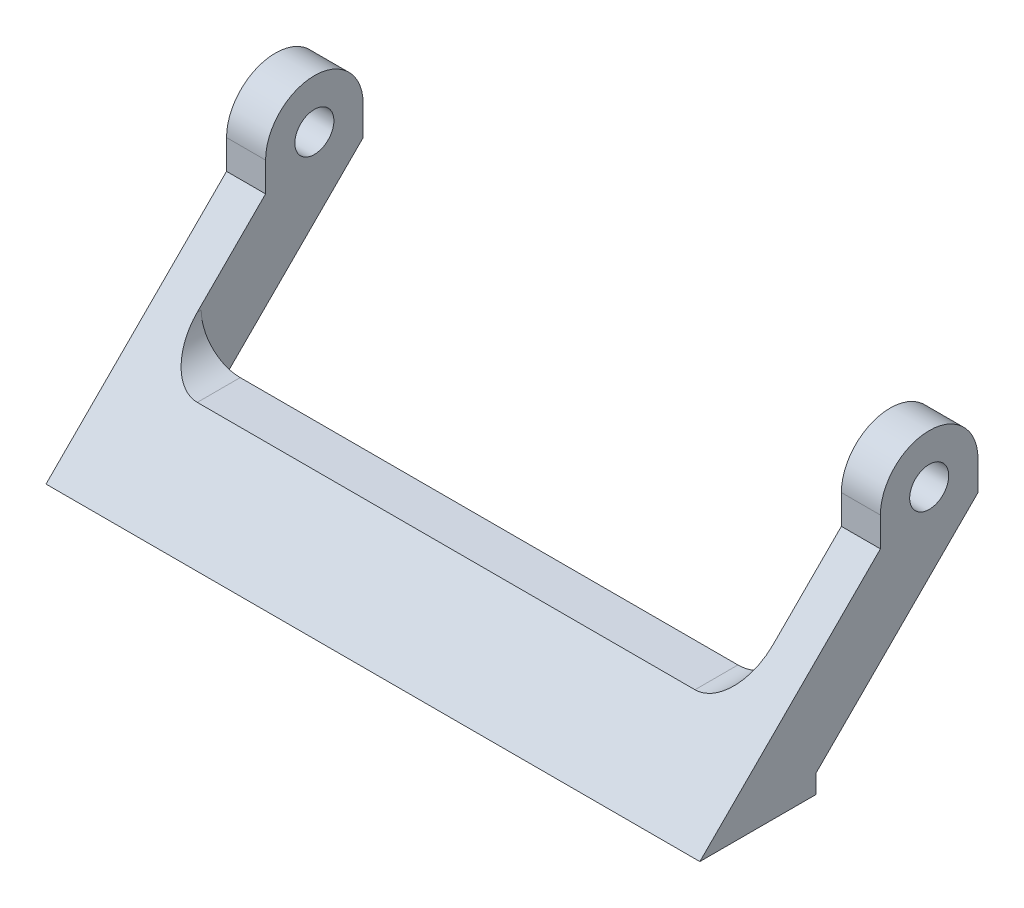
ISO-10303-21;
HEADER;
FILE_DESCRIPTION(('STEP AP214'),'2;1');
FILE_NAME('part.step','',(''),(''),'','','');
FILE_SCHEMA(('AUTOMOTIVE_DESIGN { 1 0 10303 214 1 1 1 1 }'));
ENDSEC;
DATA;
#1=APPLICATION_CONTEXT('core data for automotive mechanical design processes');
#2=APPLICATION_PROTOCOL_DEFINITION('international standard','automotive_design',2000,#1);
#3=PRODUCT_CONTEXT('',#1,'mechanical');
#4=PRODUCT('Part','Part','',(#3));
#5=PRODUCT_RELATED_PRODUCT_CATEGORY('part','',(#4));
#6=PRODUCT_DEFINITION_FORMATION('','',#4);
#7=PRODUCT_DEFINITION_CONTEXT('part definition',#1,'design');
#8=PRODUCT_DEFINITION('design','',#6,#7);
#9=PRODUCT_DEFINITION_SHAPE('','',#8);
#10=(LENGTH_UNIT() NAMED_UNIT(*) SI_UNIT(.MILLI.,.METRE.));
#11=(NAMED_UNIT(*) PLANE_ANGLE_UNIT() SI_UNIT($,.RADIAN.));
#12=(NAMED_UNIT(*) SI_UNIT($,.STERADIAN.) SOLID_ANGLE_UNIT());
#13=UNCERTAINTY_MEASURE_WITH_UNIT(LENGTH_MEASURE(1.E-05),#10,'distance_accuracy_value','');
#14=(GEOMETRIC_REPRESENTATION_CONTEXT(3) GLOBAL_UNCERTAINTY_ASSIGNED_CONTEXT((#13)) GLOBAL_UNIT_ASSIGNED_CONTEXT((#10,
#11,#12)) REPRESENTATION_CONTEXT('',''));
#15=CARTESIAN_POINT('',(0.,0.,0.));
#16=DIRECTION('',(0.,0.,1.));
#17=DIRECTION('',(1.,0.,0.));
#18=AXIS2_PLACEMENT_3D('',#15,#16,#17);
#19=CARTESIAN_POINT('',(67.,18.5,-28.5000000000002));
#20=DIRECTION('',(0.,0.707106781186551,0.707106781186544));
#21=DIRECTION('',(0.,-0.707106781186544,0.707106781186551));
#22=AXIS2_PLACEMENT_3D('',#19,#20,#21);
#23=PLANE('',#22);
#24=DIRECTION('',(0.,0.707106781186544,-0.707106781186551));
#25=VECTOR('',#24,1.);
#26=CARTESIAN_POINT('',(4.,0.749499999999965,-10.7495));
#27=LINE('',#26,#25);
#28=CARTESIAN_POINT('',(3.99999999999998,1.9,-11.9));
#29=VERTEX_POINT('',#28);
#30=CARTESIAN_POINT('',(4.,18.5,-28.5000000000002));
#31=VERTEX_POINT('',#30);
#32=EDGE_CURVE('E153',#29,#31,#27,.T.);
#33=ORIENTED_EDGE('',*,*,#32,.F.);
#34=DIRECTION('',(-1.,0.,0.));
#35=VECTOR('',#34,1.);
#36=CARTESIAN_POINT('',(67.,1.9,-11.9));
#37=LINE('',#36,#35);
#38=CARTESIAN_POINT('',(0.,1.9,-11.9));
#39=VERTEX_POINT('',#38);
#40=EDGE_CURVE('E168',#29,#39,#37,.T.);
#41=ORIENTED_EDGE('',*,*,#40,.T.);
#42=DIRECTION('',(0.,0.707106781186544,-0.707106781186551));
#43=VECTOR('',#42,1.);
#44=CARTESIAN_POINT('',(0.,18.5,-28.5000000000002));
#45=LINE('',#44,#43);
#46=CARTESIAN_POINT('',(0.,18.5,-28.5000000000002));
#47=VERTEX_POINT('',#46);
#48=EDGE_CURVE('E213',#39,#47,#45,.T.);
#49=ORIENTED_EDGE('',*,*,#48,.T.);
#50=DIRECTION('',(-1.,0.,0.));
#51=VECTOR('',#50,1.);
#52=CARTESIAN_POINT('',(67.,18.5,-28.5000000000002));
#53=LINE('',#52,#51);
#54=EDGE_CURVE('E41',#31,#47,#53,.T.);
#55=ORIENTED_EDGE('',*,*,#54,.F.);
#56=EDGE_LOOP('',(#33,#41,#49,#55));
#57=FACE_BOUND('',#56,.T.);
#58=ADVANCED_FACE('F33',(#57),#23,.F.);
#59=CARTESIAN_POINT('',(67.,21.5,-28.5000000000002));
#60=DIRECTION('',(0.,0.,1.));
#61=DIRECTION('',(1.,0.,0.));
#62=AXIS2_PLACEMENT_3D('',#59,#60,#61);
#63=PLANE('',#62);
#64=DIRECTION('',(-1.,0.,0.));
#65=VECTOR('',#64,1.);
#66=CARTESIAN_POINT('',(67.,21.5,-28.5000000000002));
#67=LINE('',#66,#65);
#68=CARTESIAN_POINT('',(4.,21.5,-28.5000000000002));
#69=VERTEX_POINT('',#68);
#70=CARTESIAN_POINT('',(0.,21.5,-28.5000000000002));
#71=VERTEX_POINT('',#70);
#72=EDGE_CURVE('E187',#69,#71,#67,.T.);
#73=ORIENTED_EDGE('',*,*,#72,.F.);
#74=DIRECTION('',(0.,1.,0.));
#75=VECTOR('',#74,1.);
#76=CARTESIAN_POINT('',(4.,11.5,-28.5000000000002));
#77=LINE('',#76,#75);
#78=EDGE_CURVE('E265',#31,#69,#77,.T.);
#79=ORIENTED_EDGE('',*,*,#78,.F.);
#80=ORIENTED_EDGE('',*,*,#54,.T.);
#81=DIRECTION('',(0.,1.,0.));
#82=VECTOR('',#81,1.);
#83=CARTESIAN_POINT('',(0.,21.5,-28.5000000000002));
#84=LINE('',#83,#82);
#85=EDGE_CURVE('E207',#47,#71,#84,.T.);
#86=ORIENTED_EDGE('',*,*,#85,.T.);
#87=EDGE_LOOP('',(#73,#79,#80,#86));
#88=FACE_BOUND('',#87,.T.);
#89=ADVANCED_FACE('F208',(#88),#63,.F.);
#90=CARTESIAN_POINT('',(67.,21.5,-23.5000000000002));
#91=DIRECTION('',(-1.,0.,0.));
#92=DIRECTION('',(0.,0.,1.));
#93=AXIS2_PLACEMENT_3D('',#90,#91,#92);
#94=CYLINDRICAL_SURFACE('',#93,5.);
#95=DIRECTION('',(-1.,0.,0.));
#96=VECTOR('',#95,1.);
#97=CARTESIAN_POINT('',(67.,21.5,-18.5000000000002));
#98=LINE('',#97,#96);
#99=CARTESIAN_POINT('',(4.,21.5,-18.5000000000002));
#100=VERTEX_POINT('',#99);
#101=CARTESIAN_POINT('',(0.,21.5,-18.5000000000002));
#102=VERTEX_POINT('',#101);
#103=EDGE_CURVE('E184',#100,#102,#98,.T.);
#104=ORIENTED_EDGE('',*,*,#103,.F.);
#105=CARTESIAN_POINT('',(4.,21.5,-23.5000000000002));
#106=DIRECTION('',(-1.,0.,0.));
#107=DIRECTION('',(0.,-1.,0.));
#108=AXIS2_PLACEMENT_3D('',#105,#106,#107);
#109=CIRCLE('',#108,5.);
#110=EDGE_CURVE('E154',#69,#100,#109,.F.);
#111=ORIENTED_EDGE('',*,*,#110,.F.);
#112=ORIENTED_EDGE('',*,*,#72,.T.);
#113=CARTESIAN_POINT('',(0.,21.5,-23.5000000000002));
#114=DIRECTION('',(1.,0.,0.));
#115=DIRECTION('',(0.,0.,1.));
#116=AXIS2_PLACEMENT_3D('',#113,#114,#115);
#117=CIRCLE('',#116,5.);
#118=EDGE_CURVE('E202',#71,#102,#117,.T.);
#119=ORIENTED_EDGE('',*,*,#118,.T.);
#120=EDGE_LOOP('',(#104,#111,#112,#119));
#121=FACE_BOUND('',#120,.T.);
#122=ADVANCED_FACE('F200',(#121),#94,.T.);
#123=CARTESIAN_POINT('',(67.,18.5,-18.5000000000002));
#124=DIRECTION('',(0.,0.,-1.));
#125=DIRECTION('',(-1.,0.,0.));
#126=AXIS2_PLACEMENT_3D('',#123,#124,#125);
#127=PLANE('',#126);
#128=DIRECTION('',(-1.,0.,0.));
#129=VECTOR('',#128,1.);
#130=CARTESIAN_POINT('',(67.,18.5,-18.5000000000002));
#131=LINE('',#130,#129);
#132=CARTESIAN_POINT('',(4.,18.5,-18.5000000000002));
#133=VERTEX_POINT('',#132);
#134=CARTESIAN_POINT('',(0.,18.5,-18.5000000000002));
#135=VERTEX_POINT('',#134);
#136=EDGE_CURVE('E180',#133,#135,#131,.T.);
#137=ORIENTED_EDGE('',*,*,#136,.F.);
#138=DIRECTION('',(0.,-1.,0.));
#139=VECTOR('',#138,1.);
#140=CARTESIAN_POINT('',(4.,11.5,-18.5000000000002));
#141=LINE('',#140,#139);
#142=EDGE_CURVE('E275',#100,#133,#141,.T.);
#143=ORIENTED_EDGE('',*,*,#142,.F.);
#144=ORIENTED_EDGE('',*,*,#103,.T.);
#145=DIRECTION('',(0.,-1.,0.));
#146=VECTOR('',#145,1.);
#147=CARTESIAN_POINT('',(0.,18.5,-18.5000000000002));
#148=LINE('',#147,#146);
#149=EDGE_CURVE('E219',#102,#135,#148,.T.);
#150=ORIENTED_EDGE('',*,*,#149,.T.);
#151=EDGE_LOOP('',(#137,#143,#144,#150));
#152=FACE_BOUND('',#151,.T.);
#153=ADVANCED_FACE('F376',(#152),#127,.F.);
#154=CARTESIAN_POINT('',(67.,21.5,-23.5000000000002));
#155=DIRECTION('',(-1.,0.,0.));
#156=DIRECTION('',(0.,0.,1.));
#157=AXIS2_PLACEMENT_3D('',#154,#155,#156);
#158=CYLINDRICAL_SURFACE('',#157,2.00000000000001);
#159=CARTESIAN_POINT('',(4.,21.5,-23.5000000000002));
#160=DIRECTION('',(-1.,0.,0.));
#161=DIRECTION('',(0.,-1.,0.));
#162=AXIS2_PLACEMENT_3D('',#159,#160,#161);
#163=CIRCLE('',#162,2.00000000000001);
#164=CARTESIAN_POINT('',(4.,19.5,-23.5000000000002));
#165=VERTEX_POINT('',#164);
#166=EDGE_CURVE('E262',#165,#165,#163,.F.);
#167=ORIENTED_EDGE('',*,*,#166,.T.);
#168=EDGE_LOOP('',(#167));
#169=FACE_BOUND('',#168,.T.);
#170=CARTESIAN_POINT('',(0.,21.5,-23.5000000000002));
#171=DIRECTION('',(1.,0.,0.));
#172=DIRECTION('',(0.,0.,-1.));
#173=AXIS2_PLACEMENT_3D('',#170,#171,#172);
#174=CIRCLE('',#173,2.00000000000001);
#175=CARTESIAN_POINT('',(0.,21.5,-25.5000000000002));
#176=VERTEX_POINT('',#175);
#177=EDGE_CURVE('E237',#176,#176,#174,.T.);
#178=ORIENTED_EDGE('',*,*,#177,.F.);
#179=EDGE_LOOP('',(#178));
#180=FACE_BOUND('',#179,.T.);
#181=ADVANCED_FACE('F352',(#169,#180),#158,.F.);
#182=CARTESIAN_POINT('',(67.,21.5,-23.5000000000002));
#183=DIRECTION('',(-1.,0.,0.));
#184=DIRECTION('',(0.,0.,1.));
#185=AXIS2_PLACEMENT_3D('',#182,#183,#184);
#186=PLANE('',#185);
#187=DIRECTION('',(0.,0.707106781186544,-0.707106781186551));
#188=VECTOR('',#187,1.);
#189=CARTESIAN_POINT('',(67.,18.5,-28.5000000000002));
#190=LINE('',#189,#188);
#191=CARTESIAN_POINT('',(67.,1.9,-11.9));
#192=VERTEX_POINT('',#191);
#193=CARTESIAN_POINT('',(67.,18.5,-28.5000000000002));
#194=VERTEX_POINT('',#193);
#195=EDGE_CURVE('E166',#192,#194,#190,.T.);
#196=ORIENTED_EDGE('',*,*,#195,.T.);
#197=DIRECTION('',(0.,1.,0.));
#198=VECTOR('',#197,1.);
#199=CARTESIAN_POINT('',(67.,21.5,-28.5000000000002));
#200=LINE('',#199,#198);
#201=CARTESIAN_POINT('',(67.,21.5,-28.5000000000002));
#202=VERTEX_POINT('',#201);
#203=EDGE_CURVE('E231',#194,#202,#200,.T.);
#204=ORIENTED_EDGE('',*,*,#203,.T.);
#205=CARTESIAN_POINT('',(67.,21.5,-23.5000000000002));
#206=DIRECTION('',(1.,0.,0.));
#207=DIRECTION('',(0.,0.,1.));
#208=AXIS2_PLACEMENT_3D('',#205,#206,#207);
#209=CIRCLE('',#208,5.);
#210=CARTESIAN_POINT('',(67.,21.5,-18.5000000000002));
#211=VERTEX_POINT('',#210);
#212=EDGE_CURVE('E234',#202,#211,#209,.T.);
#213=ORIENTED_EDGE('',*,*,#212,.T.);
#214=DIRECTION('',(0.,-1.,0.));
#215=VECTOR('',#214,1.);
#216=CARTESIAN_POINT('',(67.,18.5,-18.5000000000002));
#217=LINE('',#216,#215);
#218=CARTESIAN_POINT('',(67.,18.5,-18.5000000000002));
#219=VERTEX_POINT('',#218);
#220=EDGE_CURVE('E241',#211,#219,#217,.T.);
#221=ORIENTED_EDGE('',*,*,#220,.T.);
#222=DIRECTION('',(0.,-0.707106781186544,0.707106781186551));
#223=VECTOR('',#222,1.);
#224=CARTESIAN_POINT('',(67.,0.,0.));
#225=LINE('',#224,#223);
#226=CARTESIAN_POINT('',(67.,0.,0.));
#227=VERTEX_POINT('',#226);
#228=EDGE_CURVE('E243',#219,#227,#225,.T.);
#229=ORIENTED_EDGE('',*,*,#228,.T.);
#230=DIRECTION('',(0.,0.,-1.));
#231=VECTOR('',#230,1.);
#232=CARTESIAN_POINT('',(67.,0.,-11.9));
#233=LINE('',#232,#231);
#234=CARTESIAN_POINT('',(67.,0.,-11.9));
#235=VERTEX_POINT('',#234);
#236=EDGE_CURVE('E245',#227,#235,#233,.T.);
#237=ORIENTED_EDGE('',*,*,#236,.T.);
#238=DIRECTION('',(0.,1.,0.));
#239=VECTOR('',#238,1.);
#240=CARTESIAN_POINT('',(67.,1.9,-11.9));
#241=LINE('',#240,#239);
#242=EDGE_CURVE('E173',#235,#192,#241,.T.);
#243=ORIENTED_EDGE('',*,*,#242,.T.);
#244=EDGE_LOOP('',(#196,#204,#213,#221,#229,#237,#243));
#245=FACE_BOUND('',#244,.T.);
#246=CARTESIAN_POINT('',(67.,21.5,-23.5000000000002));
#247=DIRECTION('',(1.,0.,0.));
#248=DIRECTION('',(0.,0.,-1.));
#249=AXIS2_PLACEMENT_3D('',#246,#247,#248);
#250=CIRCLE('',#249,2.00000000000001);
#251=CARTESIAN_POINT('',(67.,21.5,-25.5000000000002));
#252=VERTEX_POINT('',#251);
#253=EDGE_CURVE('E247',#252,#252,#250,.T.);
#254=ORIENTED_EDGE('',*,*,#253,.F.);
#255=EDGE_LOOP('',(#254));
#256=FACE_BOUND('',#255,.T.);
#257=ADVANCED_FACE('F325',(#245,#256),#186,.F.);
#258=CARTESIAN_POINT('',(0.,21.5,-23.5000000000002));
#259=DIRECTION('',(-1.,0.,0.));
#260=DIRECTION('',(0.,0.,1.));
#261=AXIS2_PLACEMENT_3D('',#258,#259,#260);
#262=PLANE('',#261);
#263=ORIENTED_EDGE('',*,*,#48,.F.);
#264=DIRECTION('',(0.,1.,0.));
#265=VECTOR('',#264,1.);
#266=CARTESIAN_POINT('',(0.,1.9,-11.9));
#267=LINE('',#266,#265);
#268=CARTESIAN_POINT('',(0.,0.,-11.9));
#269=VERTEX_POINT('',#268);
#270=EDGE_CURVE('E175',#269,#39,#267,.T.);
#271=ORIENTED_EDGE('',*,*,#270,.F.);
#272=DIRECTION('',(0.,0.,-1.));
#273=VECTOR('',#272,1.);
#274=CARTESIAN_POINT('',(0.,0.,-11.9));
#275=LINE('',#274,#273);
#276=CARTESIAN_POINT('',(0.,0.,0.));
#277=VERTEX_POINT('',#276);
#278=EDGE_CURVE('E225',#277,#269,#275,.T.);
#279=ORIENTED_EDGE('',*,*,#278,.F.);
#280=DIRECTION('',(0.,-0.707106781186544,0.707106781186551));
#281=VECTOR('',#280,1.);
#282=CARTESIAN_POINT('',(0.,0.,0.));
#283=LINE('',#282,#281);
#284=EDGE_CURVE('E221',#135,#277,#283,.T.);
#285=ORIENTED_EDGE('',*,*,#284,.F.);
#286=ORIENTED_EDGE('',*,*,#149,.F.);
#287=ORIENTED_EDGE('',*,*,#118,.F.);
#288=ORIENTED_EDGE('',*,*,#85,.F.);
#289=EDGE_LOOP('',(#263,#271,#279,#285,#286,#287,#288));
#290=FACE_BOUND('',#289,.T.);
#291=ORIENTED_EDGE('',*,*,#177,.T.);
#292=EDGE_LOOP('',(#291));
#293=FACE_BOUND('',#292,.T.);
#294=ADVANCED_FACE('F215',(#290,#293),#262,.T.);
#295=CARTESIAN_POINT('',(63.,1.9,-11.9));
#296=VERTEX_POINT('',#295);
#297=EDGE_CURVE('E160',#192,#296,#37,.T.);
#298=ORIENTED_EDGE('',*,*,#297,.T.);
#299=DIRECTION('',(0.,-0.707106781186544,0.707106781186551));
#300=VECTOR('',#299,1.);
#301=CARTESIAN_POINT('',(63.,8.24949999999988,-18.2494999999999));
#302=LINE('',#301,#300);
#303=CARTESIAN_POINT('',(63.,18.5,-28.5000000000002));
#304=VERTEX_POINT('',#303);
#305=EDGE_CURVE('E145',#304,#296,#302,.T.);
#306=ORIENTED_EDGE('',*,*,#305,.F.);
#307=EDGE_CURVE('E11',#194,#304,#53,.T.);
#308=ORIENTED_EDGE('',*,*,#307,.F.);
#309=ORIENTED_EDGE('',*,*,#195,.F.);
#310=EDGE_LOOP('',(#298,#306,#308,#309));
#311=FACE_BOUND('',#310,.T.);
#312=ADVANCED_FACE('F35',(#311),#23,.F.);
#313=ORIENTED_EDGE('',*,*,#307,.T.);
#314=DIRECTION('',(0.,-1.,0.));
#315=VECTOR('',#314,1.);
#316=CARTESIAN_POINT('',(63.,26.5,-28.5000000000002));
#317=LINE('',#316,#315);
#318=CARTESIAN_POINT('',(63.,21.5,-28.5000000000002));
#319=VERTEX_POINT('',#318);
#320=EDGE_CURVE('E149',#319,#304,#317,.T.);
#321=ORIENTED_EDGE('',*,*,#320,.F.);
#322=EDGE_CURVE('E188',#202,#319,#67,.T.);
#323=ORIENTED_EDGE('',*,*,#322,.F.);
#324=ORIENTED_EDGE('',*,*,#203,.F.);
#325=EDGE_LOOP('',(#313,#321,#323,#324));
#326=FACE_BOUND('',#325,.T.);
#327=ADVANCED_FACE('F324',(#326),#63,.F.);
#328=ORIENTED_EDGE('',*,*,#322,.T.);
#329=CARTESIAN_POINT('',(63.,21.5,-23.5000000000002));
#330=DIRECTION('',(1.,0.,0.));
#331=DIRECTION('',(0.,0.,-1.));
#332=AXIS2_PLACEMENT_3D('',#329,#330,#331);
#333=CIRCLE('',#332,5.);
#334=CARTESIAN_POINT('',(63.,21.5,-18.5000000000002));
#335=VERTEX_POINT('',#334);
#336=EDGE_CURVE('E289',#335,#319,#333,.F.);
#337=ORIENTED_EDGE('',*,*,#336,.F.);
#338=EDGE_CURVE('E185',#211,#335,#98,.T.);
#339=ORIENTED_EDGE('',*,*,#338,.F.);
#340=ORIENTED_EDGE('',*,*,#212,.F.);
#341=EDGE_LOOP('',(#328,#337,#339,#340));
#342=FACE_BOUND('',#341,.T.);
#343=ADVANCED_FACE('F322',(#342),#94,.T.);
#344=ORIENTED_EDGE('',*,*,#338,.T.);
#345=DIRECTION('',(0.,1.,0.));
#346=VECTOR('',#345,1.);
#347=CARTESIAN_POINT('',(63.,26.5,-18.5000000000002));
#348=LINE('',#347,#346);
#349=CARTESIAN_POINT('',(63.,18.5,-18.5000000000002));
#350=VERTEX_POINT('',#349);
#351=EDGE_CURVE('E253',#350,#335,#348,.T.);
#352=ORIENTED_EDGE('',*,*,#351,.F.);
#353=EDGE_CURVE('E181',#219,#350,#131,.T.);
#354=ORIENTED_EDGE('',*,*,#353,.F.);
#355=ORIENTED_EDGE('',*,*,#220,.F.);
#356=EDGE_LOOP('',(#344,#352,#354,#355));
#357=FACE_BOUND('',#356,.T.);
#358=ADVANCED_FACE('F319',(#357),#127,.F.);
#359=CARTESIAN_POINT('',(67.,0.,0.));
#360=DIRECTION('',(0.,-0.707106781186551,-0.707106781186544));
#361=DIRECTION('',(0.,0.707106781186544,-0.707106781186551));
#362=AXIS2_PLACEMENT_3D('',#359,#360,#361);
#363=PLANE('',#362);
#364=CARTESIAN_POINT('',(8.,11.5,-11.5000000000001));
#365=DIRECTION('',(0.,-0.707106781186551,-0.707106781186544));
#366=DIRECTION('',(0.,0.707106781186544,-0.707106781186551));
#367=AXIS2_PLACEMENT_3D('',#364,#365,#366);
#368=ELLIPSE('',#367,5.65685424949241,4.);
#369=CARTESIAN_POINT('',(4.,11.5,-11.5000000000001));
#370=VERTEX_POINT('',#369);
#371=CARTESIAN_POINT('',(8.00000000000004,7.5,-7.50000000000008));
#372=VERTEX_POINT('',#371);
#373=EDGE_CURVE('E279',#370,#372,#368,.F.);
#374=ORIENTED_EDGE('',*,*,#373,.F.);
#375=DIRECTION('',(0.,-0.707106781186544,0.707106781186551));
#376=VECTOR('',#375,1.);
#377=CARTESIAN_POINT('',(4.,5.74949999999996,-5.74950000000001));
#378=LINE('',#377,#376);
#379=EDGE_CURVE('E277',#133,#370,#378,.T.);
#380=ORIENTED_EDGE('',*,*,#379,.F.);
#381=ORIENTED_EDGE('',*,*,#136,.T.);
#382=ORIENTED_EDGE('',*,*,#284,.T.);
#383=DIRECTION('',(-1.,0.,0.));
#384=VECTOR('',#383,1.);
#385=CARTESIAN_POINT('',(67.,0.,0.));
#386=LINE('',#385,#384);
#387=EDGE_CURVE('E171',#227,#277,#386,.T.);
#388=ORIENTED_EDGE('',*,*,#387,.F.);
#389=ORIENTED_EDGE('',*,*,#228,.F.);
#390=ORIENTED_EDGE('',*,*,#353,.T.);
#391=DIRECTION('',(0.,0.707106781186544,-0.707106781186551));
#392=VECTOR('',#391,1.);
#393=CARTESIAN_POINT('',(63.,13.2494999999999,-13.2495));
#394=LINE('',#393,#392);
#395=CARTESIAN_POINT('',(63.,11.5,-11.5000000000001));
#396=VERTEX_POINT('',#395);
#397=EDGE_CURVE('E256',#396,#350,#394,.T.);
#398=ORIENTED_EDGE('',*,*,#397,.F.);
#399=CARTESIAN_POINT('',(59.,11.5,-11.5000000000001));
#400=DIRECTION('',(0.,-0.707106781186551,-0.707106781186544));
#401=DIRECTION('',(0.,0.707106781186544,-0.707106781186551));
#402=AXIS2_PLACEMENT_3D('',#399,#400,#401);
#403=ELLIPSE('',#402,5.65685424949241,4.);
#404=CARTESIAN_POINT('',(59.,7.5,-7.50000000000007));
#405=VERTEX_POINT('',#404);
#406=EDGE_CURVE('E283',#405,#396,#403,.F.);
#407=ORIENTED_EDGE('',*,*,#406,.F.);
#408=DIRECTION('',(1.,0.,0.));
#409=VECTOR('',#408,1.);
#410=CARTESIAN_POINT('',(59.,7.5,-7.50000000000008));
#411=LINE('',#410,#409);
#412=EDGE_CURVE('E281',#372,#405,#411,.T.);
#413=ORIENTED_EDGE('',*,*,#412,.F.);
#414=EDGE_LOOP('',(#374,#380,#381,#382,#388,#389,#390,#398,#407,#413));
#415=FACE_BOUND('',#414,.T.);
#416=ADVANCED_FACE('F309',(#415),#363,.F.);
#417=CARTESIAN_POINT('',(67.,0.,-11.9));
#418=DIRECTION('',(0.,1.,0.));
#419=DIRECTION('',(0.,0.,1.));
#420=AXIS2_PLACEMENT_3D('',#417,#418,#419);
#421=PLANE('',#420);
#422=ORIENTED_EDGE('',*,*,#278,.T.);
#423=DIRECTION('',(-1.,0.,0.));
#424=VECTOR('',#423,1.);
#425=CARTESIAN_POINT('',(67.,0.,-11.9));
#426=LINE('',#425,#424);
#427=EDGE_CURVE('E167',#235,#269,#426,.T.);
#428=ORIENTED_EDGE('',*,*,#427,.F.);
#429=ORIENTED_EDGE('',*,*,#236,.F.);
#430=ORIENTED_EDGE('',*,*,#387,.T.);
#431=EDGE_LOOP('',(#422,#428,#429,#430));
#432=FACE_BOUND('',#431,.T.);
#433=ADVANCED_FACE('F329',(#432),#421,.F.);
#434=CARTESIAN_POINT('',(67.,1.9,-11.9));
#435=DIRECTION('',(0.,0.,1.));
#436=DIRECTION('',(1.,0.,0.));
#437=AXIS2_PLACEMENT_3D('',#434,#435,#436);
#438=PLANE('',#437);
#439=ORIENTED_EDGE('',*,*,#270,.T.);
#440=ORIENTED_EDGE('',*,*,#40,.F.);
#441=DIRECTION('',(0.,-1.,0.));
#442=VECTOR('',#441,1.);
#443=CARTESIAN_POINT('',(3.99999999999998,26.501,-11.9));
#444=LINE('',#443,#442);
#445=CARTESIAN_POINT('',(3.99999999999998,11.5,-11.9));
#446=VERTEX_POINT('',#445);
#447=EDGE_CURVE('E162',#446,#29,#444,.T.);
#448=ORIENTED_EDGE('',*,*,#447,.F.);
#449=CARTESIAN_POINT('',(8.,11.5,-11.9));
#450=DIRECTION('',(0.,0.,1.));
#451=DIRECTION('',(0.,-1.,0.));
#452=AXIS2_PLACEMENT_3D('',#449,#450,#451);
#453=CIRCLE('',#452,4.);
#454=CARTESIAN_POINT('',(8.00000000000003,7.5,-11.9));
#455=VERTEX_POINT('',#454);
#456=EDGE_CURVE('E163',#446,#455,#453,.T.);
#457=ORIENTED_EDGE('',*,*,#456,.T.);
#458=DIRECTION('',(1.,0.,0.));
#459=VECTOR('',#458,1.);
#460=CARTESIAN_POINT('',(3.99999999999998,7.5,-11.9));
#461=LINE('',#460,#459);
#462=CARTESIAN_POINT('',(59.,7.5,-11.9));
#463=VERTEX_POINT('',#462);
#464=EDGE_CURVE('E291',#455,#463,#461,.T.);
#465=ORIENTED_EDGE('',*,*,#464,.T.);
#466=CARTESIAN_POINT('',(59.,11.5,-11.9));
#467=DIRECTION('',(0.,0.,1.));
#468=DIRECTION('',(0.,-1.,0.));
#469=AXIS2_PLACEMENT_3D('',#466,#467,#468);
#470=CIRCLE('',#469,4.);
#471=CARTESIAN_POINT('',(63.,11.5,-11.9));
#472=VERTEX_POINT('',#471);
#473=EDGE_CURVE('E48',#463,#472,#470,.T.);
#474=ORIENTED_EDGE('',*,*,#473,.T.);
#475=DIRECTION('',(0.,-1.,0.));
#476=VECTOR('',#475,1.);
#477=CARTESIAN_POINT('',(63.,26.501,-11.9));
#478=LINE('',#477,#476);
#479=EDGE_CURVE('E147',#472,#296,#478,.T.);
#480=ORIENTED_EDGE('',*,*,#479,.T.);
#481=ORIENTED_EDGE('',*,*,#297,.F.);
#482=ORIENTED_EDGE('',*,*,#242,.F.);
#483=ORIENTED_EDGE('',*,*,#427,.T.);
#484=EDGE_LOOP('',(#439,#440,#448,#457,#465,#474,#480,#481,#482,#483));
#485=FACE_BOUND('',#484,.T.);
#486=ADVANCED_FACE('F158',(#485),#438,.F.);
#487=CARTESIAN_POINT('',(63.,21.5,-23.5000000000002));
#488=DIRECTION('',(1.,0.,0.));
#489=DIRECTION('',(0.,0.,-1.));
#490=AXIS2_PLACEMENT_3D('',#487,#488,#489);
#491=CIRCLE('',#490,2.00000000000001);
#492=CARTESIAN_POINT('',(63.,21.5,-25.5000000000002));
#493=VERTEX_POINT('',#492);
#494=EDGE_CURVE('E259',#493,#493,#491,.F.);
#495=ORIENTED_EDGE('',*,*,#494,.T.);
#496=EDGE_LOOP('',(#495));
#497=FACE_BOUND('',#496,.T.);
#498=ORIENTED_EDGE('',*,*,#253,.T.);
#499=EDGE_LOOP('',(#498));
#500=FACE_BOUND('',#499,.T.);
#501=ADVANCED_FACE('F336',(#497,#500),#158,.F.);
#502=CARTESIAN_POINT('',(4.,11.5,0.001000000000001));
#503=DIRECTION('',(-1.,0.,0.));
#504=DIRECTION('',(0.,-1.,0.));
#505=AXIS2_PLACEMENT_3D('',#502,#503,#504);
#506=PLANE('',#505);
#507=ORIENTED_EDGE('',*,*,#166,.F.);
#508=EDGE_LOOP('',(#507));
#509=FACE_BOUND('',#508,.T.);
#510=ORIENTED_EDGE('',*,*,#32,.T.);
#511=ORIENTED_EDGE('',*,*,#78,.T.);
#512=ORIENTED_EDGE('',*,*,#110,.T.);
#513=ORIENTED_EDGE('',*,*,#142,.T.);
#514=ORIENTED_EDGE('',*,*,#379,.T.);
#515=DIRECTION('',(0.,0.,-1.));
#516=VECTOR('',#515,1.);
#517=CARTESIAN_POINT('',(4.,11.5,0.001000000000001));
#518=LINE('',#517,#516);
#519=EDGE_CURVE('E258',#370,#446,#518,.T.);
#520=ORIENTED_EDGE('',*,*,#519,.T.);
#521=ORIENTED_EDGE('',*,*,#447,.T.);
#522=EDGE_LOOP('',(#510,#511,#512,#513,#514,#520,#521));
#523=FACE_BOUND('',#522,.T.);
#524=ADVANCED_FACE('F357',(#509,#523),#506,.F.);
#525=CARTESIAN_POINT('',(8.,11.5,0.001000000000001));
#526=DIRECTION('',(0.,0.,-1.));
#527=DIRECTION('',(-1.,0.,0.));
#528=AXIS2_PLACEMENT_3D('',#525,#526,#527);
#529=CYLINDRICAL_SURFACE('',#528,4.);
#530=DIRECTION('',(0.,0.,-1.));
#531=VECTOR('',#530,1.);
#532=CARTESIAN_POINT('',(8.00000000000003,7.5,0.001000000000001));
#533=LINE('',#532,#531);
#534=EDGE_CURVE('E268',#372,#455,#533,.T.);
#535=ORIENTED_EDGE('',*,*,#534,.T.);
#536=ORIENTED_EDGE('',*,*,#456,.F.);
#537=ORIENTED_EDGE('',*,*,#519,.F.);
#538=ORIENTED_EDGE('',*,*,#373,.T.);
#539=EDGE_LOOP('',(#535,#536,#537,#538));
#540=FACE_BOUND('',#539,.T.);
#541=ADVANCED_FACE('F305',(#540),#529,.F.);
#542=CARTESIAN_POINT('',(59.,7.5,0.001000000000001));
#543=DIRECTION('',(0.,-1.,0.));
#544=DIRECTION('',(0.,0.,-1.));
#545=AXIS2_PLACEMENT_3D('',#542,#543,#544);
#546=PLANE('',#545);
#547=DIRECTION('',(0.,0.,-1.));
#548=VECTOR('',#547,1.);
#549=CARTESIAN_POINT('',(59.,7.5,0.001000000000001));
#550=LINE('',#549,#548);
#551=EDGE_CURVE('E264',#405,#463,#550,.T.);
#552=ORIENTED_EDGE('',*,*,#551,.T.);
#553=ORIENTED_EDGE('',*,*,#464,.F.);
#554=ORIENTED_EDGE('',*,*,#534,.F.);
#555=ORIENTED_EDGE('',*,*,#412,.T.);
#556=EDGE_LOOP('',(#552,#553,#554,#555));
#557=FACE_BOUND('',#556,.T.);
#558=ADVANCED_FACE('F302',(#557),#546,.F.);
#559=CARTESIAN_POINT('',(59.,11.5,0.001000000000001));
#560=DIRECTION('',(0.,0.,-1.));
#561=DIRECTION('',(-1.,0.,0.));
#562=AXIS2_PLACEMENT_3D('',#559,#560,#561);
#563=CYLINDRICAL_SURFACE('',#562,4.);
#564=DIRECTION('',(0.,0.,-1.));
#565=VECTOR('',#564,1.);
#566=CARTESIAN_POINT('',(63.,11.5,0.001000000000001));
#567=LINE('',#566,#565);
#568=EDGE_CURVE('E55',#396,#472,#567,.T.);
#569=ORIENTED_EDGE('',*,*,#568,.T.);
#570=ORIENTED_EDGE('',*,*,#473,.F.);
#571=ORIENTED_EDGE('',*,*,#551,.F.);
#572=ORIENTED_EDGE('',*,*,#406,.T.);
#573=EDGE_LOOP('',(#569,#570,#571,#572));
#574=FACE_BOUND('',#573,.T.);
#575=ADVANCED_FACE('F314',(#574),#563,.F.);
#576=CARTESIAN_POINT('',(63.,26.5,0.001000000000001));
#577=DIRECTION('',(1.,0.,0.));
#578=DIRECTION('',(0.,0.,-1.));
#579=AXIS2_PLACEMENT_3D('',#576,#577,#578);
#580=PLANE('',#579);
#581=ORIENTED_EDGE('',*,*,#494,.F.);
#582=EDGE_LOOP('',(#581));
#583=FACE_BOUND('',#582,.T.);
#584=ORIENTED_EDGE('',*,*,#305,.T.);
#585=ORIENTED_EDGE('',*,*,#479,.F.);
#586=ORIENTED_EDGE('',*,*,#568,.F.);
#587=ORIENTED_EDGE('',*,*,#397,.T.);
#588=ORIENTED_EDGE('',*,*,#351,.T.);
#589=ORIENTED_EDGE('',*,*,#336,.T.);
#590=ORIENTED_EDGE('',*,*,#320,.T.);
#591=EDGE_LOOP('',(#584,#585,#586,#587,#588,#589,#590));
#592=FACE_BOUND('',#591,.T.);
#593=ADVANCED_FACE('F146',(#583,#592),#580,.F.);
#594=CLOSED_SHELL('',(#58,#89,#122,#153,#181,#257,#294,#312,#327,#343,#358,#416,#433,#486,#501,
#524,#541,#558,#575,#593));
#595=MANIFOLD_SOLID_BREP('B2',#594);
#596=ADVANCED_BREP_SHAPE_REPRESENTATION('',(#18,#595),#14);
#597=SHAPE_DEFINITION_REPRESENTATION(#9,#596);
ENDSEC;
END-ISO-10303-21;
